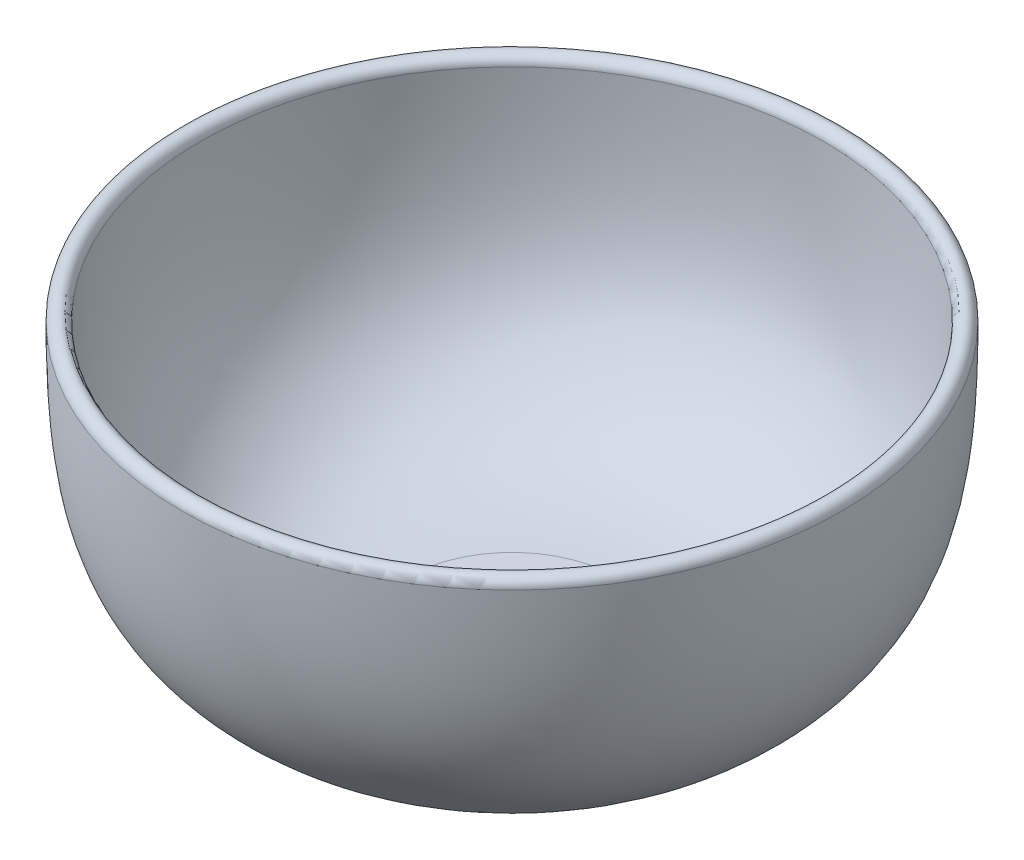
ISO-10303-21;
HEADER;
FILE_DESCRIPTION(('STEP AP214'),'2;1');
FILE_NAME('part.step','',(''),(''),'','','');
FILE_SCHEMA(('AUTOMOTIVE_DESIGN { 1 0 10303 214 1 1 1 1 }'));
ENDSEC;
DATA;
#1=APPLICATION_CONTEXT('core data for automotive mechanical design processes');
#2=APPLICATION_PROTOCOL_DEFINITION('international standard','automotive_design',2000,#1);
#3=PRODUCT_CONTEXT('',#1,'mechanical');
#4=PRODUCT('Part','Part','',(#3));
#5=PRODUCT_RELATED_PRODUCT_CATEGORY('part','',(#4));
#6=PRODUCT_DEFINITION_FORMATION('','',#4);
#7=PRODUCT_DEFINITION_CONTEXT('part definition',#1,'design');
#8=PRODUCT_DEFINITION('design','',#6,#7);
#9=PRODUCT_DEFINITION_SHAPE('','',#8);
#10=(LENGTH_UNIT() NAMED_UNIT(*) SI_UNIT(.MILLI.,.METRE.));
#11=(NAMED_UNIT(*) PLANE_ANGLE_UNIT() SI_UNIT($,.RADIAN.));
#12=(NAMED_UNIT(*) SI_UNIT($,.STERADIAN.) SOLID_ANGLE_UNIT());
#13=UNCERTAINTY_MEASURE_WITH_UNIT(LENGTH_MEASURE(1.E-05),#10,'distance_accuracy_value','');
#14=(GEOMETRIC_REPRESENTATION_CONTEXT(3) GLOBAL_UNCERTAINTY_ASSIGNED_CONTEXT((#13)) GLOBAL_UNIT_ASSIGNED_CONTEXT((#10,
#11,#12)) REPRESENTATION_CONTEXT('',''));
#15=CARTESIAN_POINT('',(0.,0.,0.));
#16=DIRECTION('',(0.,0.,1.));
#17=DIRECTION('',(1.,0.,0.));
#18=AXIS2_PLACEMENT_3D('',#15,#16,#17);
#19=CARTESIAN_POINT('',(0.,-37.46,0.));
#20=DIRECTION('',(0.,-1.,0.));
#21=DIRECTION('',(0.,0.,-1.));
#22=AXIS2_PLACEMENT_3D('',#19,#20,#21);
#23=PLANE('',#22);
#24=CARTESIAN_POINT('',(0.,-37.46,0.));
#25=DIRECTION('',(0.,-1.,0.));
#26=DIRECTION('',(0.,0.,-1.));
#27=AXIS2_PLACEMENT_3D('',#24,#25,#26);
#28=CIRCLE('',#27,30.);
#29=CARTESIAN_POINT('',(0.,-37.46,-30.));
#30=VERTEX_POINT('',#29);
#31=EDGE_CURVE('E10',#30,#30,#28,.T.);
#32=ORIENTED_EDGE('',*,*,#31,.F.);
#33=EDGE_LOOP('',(#32));
#34=FACE_BOUND('',#33,.T.);
#35=ADVANCED_FACE('F30',(#34),#23,.F.);
#36=CARTESIAN_POINT('',(-30.,-37.46,0.));
#37=CARTESIAN_POINT('',(-30.8609876554189,-37.46,0.));
#38=CARTESIAN_POINT('',(-32.6063848749734,-37.4361149045419,0.));
#39=CARTESIAN_POINT('',(-35.9078657835529,-37.2964068616734,0.));
#40=CARTESIAN_POINT('',(-39.8177778317078,-36.9561480547544,0.));
#41=CARTESIAN_POINT('',(-44.1416387662385,-36.3044528033411,0.));
#42=CARTESIAN_POINT('',(-49.4591312105799,-35.1393553086315,0.));
#43=CARTESIAN_POINT('',(-55.3145421037803,-33.18037126707,0.));
#44=CARTESIAN_POINT('',(-61.2602729286897,-30.1809372189808,0.));
#45=CARTESIAN_POINT('',(-66.3060970475642,-26.6748634007322,0.));
#46=CARTESIAN_POINT('',(-70.6280170925905,-22.778750971287,0.));
#47=CARTESIAN_POINT('',(-74.3605139176317,-18.6632436794776,0.));
#48=CARTESIAN_POINT('',(-78.5536869471952,-12.8922017614715,0.));
#49=CARTESIAN_POINT('',(-81.7204520293691,-6.46384050108864,0.));
#50=CARTESIAN_POINT('',(-84.0380987932712,1.01193175229893,0.));
#51=CARTESIAN_POINT('',(-85.3834651682277,7.23379839651148,0.));
#52=CARTESIAN_POINT('',(-86.3679223369294,14.152286295039,0.));
#53=CARTESIAN_POINT('',(-86.9148722671776,20.5612454926086,0.));
#54=CARTESIAN_POINT('',(-87.206068290206,26.1117973199665,0.));
#55=CARTESIAN_POINT('',(-87.3559267331404,30.493774797307,0.));
#56=CARTESIAN_POINT('',(-87.4276274316719,34.3412657490349,0.));
#57=CARTESIAN_POINT('',(-87.4554922617751,37.5283983256624,0.));
#58=CARTESIAN_POINT('',(-87.46,39.1810536668984,0.));
#59=CARTESIAN_POINT('',(-87.46,40.0000000000001,0.));
#60=B_SPLINE_CURVE_WITH_KNOTS('',3,(#36,#37,#38,#39,#40,#41,#42,#43,#44,#45,#46,#47,#48,#49,#50,
#51,#52,#53,#54,#55,#56,#57,#58,#59),.UNSPECIFIED.,.F.,.F.,(4,1,1,1,1,1,1,1,1,1,1,1,1,1,1,1,1,1,
1,1,1,4),(0.,0.015625,0.03125,0.0625,0.09375,0.125,0.1875,0.25,0.3125,0.375,0.4375,0.5,0.625,
0.6875,0.75,0.8125,0.875,0.90625,0.9375,0.96875,0.984375,1.),.UNSPECIFIED.);
#61=CARTESIAN_POINT('',(0.,-40.,0.));
#62=DIRECTION('',(0.,-1.,0.));
#63=AXIS1_PLACEMENT('',#61,#62);
#64=SURFACE_OF_REVOLUTION('',#60,#63);
#65=CARTESIAN_POINT('',(0.,40.0000000000001,0.));
#66=DIRECTION('',(0.,-1.,0.));
#67=DIRECTION('',(0.,0.,-1.));
#68=AXIS2_PLACEMENT_3D('',#65,#66,#67);
#69=CIRCLE('',#68,87.46);
#70=CARTESIAN_POINT('',(0.,40.0000000000001,-87.46));
#71=VERTEX_POINT('',#70);
#72=EDGE_CURVE('E36',#71,#71,#69,.T.);
#73=ORIENTED_EDGE('',*,*,#72,.F.);
#74=EDGE_LOOP('',(#73));
#75=FACE_BOUND('',#74,.T.);
#76=ORIENTED_EDGE('',*,*,#31,.T.);
#77=EDGE_LOOP('',(#76));
#78=FACE_BOUND('',#77,.T.);
#79=ADVANCED_FACE('F68',(#75,#78),#64,.T.);
#80=CARTESIAN_POINT('',(0.,40.,0.));
#81=DIRECTION('',(0.,-1.,0.));
#82=DIRECTION('',(0.,0.,-1.));
#83=AXIS2_PLACEMENT_3D('',#80,#81,#82);
#84=TOROIDAL_SURFACE('',#83,90.,2.54);
#85=CARTESIAN_POINT('',(0.,40.0000000000001,0.));
#86=DIRECTION('',(0.,-1.,0.));
#87=DIRECTION('',(0.,0.,-1.));
#88=AXIS2_PLACEMENT_3D('',#85,#86,#87);
#89=CIRCLE('',#88,92.54);
#90=CARTESIAN_POINT('',(0.,40.0000000000001,-92.54));
#91=VERTEX_POINT('',#90);
#92=EDGE_CURVE('E40',#91,#91,#89,.T.);
#93=ORIENTED_EDGE('',*,*,#92,.F.);
#94=EDGE_LOOP('',(#93));
#95=FACE_BOUND('',#94,.T.);
#96=ORIENTED_EDGE('',*,*,#72,.T.);
#97=EDGE_LOOP('',(#96));
#98=FACE_BOUND('',#97,.T.);
#99=ADVANCED_FACE('F65',(#95,#98),#84,.T.);
#100=CARTESIAN_POINT('',(-92.54,40.0000000000001,0.));
#101=CARTESIAN_POINT('',(-92.54,39.1714013624818,0.));
#102=CARTESIAN_POINT('',(-92.5354424984541,37.5001078512954,0.));
#103=CARTESIAN_POINT('',(-92.5072160098302,34.2703683642136,0.));
#104=CARTESIAN_POINT('',(-92.4344386964938,30.3628240644551,0.));
#105=CARTESIAN_POINT('',(-92.2817421044564,25.8954803250334,0.));
#106=CARTESIAN_POINT('',(-91.9836902187043,20.2119845231245,0.));
#107=CARTESIAN_POINT('',(-91.4201314915007,13.5974022157106,0.));
#108=CARTESIAN_POINT('',(-90.3920576014283,6.35964446557678,0.));
#109=CARTESIAN_POINT('',(-88.9634065117371,-0.257946307391095,0.));
#110=CARTESIAN_POINT('',(-86.4581141709394,-8.35347945843737,0.));
#111=CARTESIAN_POINT('',(-82.9531694814845,-15.4877526105312,0.));
#112=CARTESIAN_POINT('',(-78.2970707365304,-21.8889771988445,0.));
#113=CARTESIAN_POINT('',(-74.2278774634407,-26.3752817797554,0.));
#114=CARTESIAN_POINT('',(-69.4783799847724,-30.6598637827847,0.));
#115=CARTESIAN_POINT('',(-63.8631554212189,-34.563591190295,0.));
#116=CARTESIAN_POINT('',(-57.2570381164248,-37.8938253477865,0.));
#117=CARTESIAN_POINT('',(-50.8228311831737,-40.0426883640367,0.));
#118=CARTESIAN_POINT('',(-45.0564191580813,-41.3051731180868,0.));
#119=CARTESIAN_POINT('',(-40.4083720599776,-42.0050357862125,0.));
#120=CARTESIAN_POINT('',(-36.24292248518,-42.3670418503605,0.));
#121=CARTESIAN_POINT('',(-32.7460389759728,-42.514860457293,0.));
#122=CARTESIAN_POINT('',(-30.9079620028248,-42.54,0.));
#123=CARTESIAN_POINT('',(-30.,-42.54,0.));
#124=B_SPLINE_CURVE_WITH_KNOTS('',3,(#100,#101,#102,#103,#104,#105,#106,#107,#108,#109,#110,
#111,#112,#113,#114,#115,#116,#117,#118,#119,#120,#121,#122,#123),.UNSPECIFIED.,.F.,.F.,(4,1,1,
1,1,1,1,1,1,1,1,1,1,1,1,1,1,1,1,1,1,4),(0.,0.015625,0.03125,0.0625,0.09375,0.125,0.1875,0.25,
0.3125,0.375,0.5,0.5625,0.625,0.6875,0.75,0.8125,0.875,0.90625,0.9375,0.96875,0.984375,1.),.UNSPECIFIED.);
#125=CARTESIAN_POINT('',(0.,-40.,0.));
#126=DIRECTION('',(0.,-1.,0.));
#127=AXIS1_PLACEMENT('',#125,#126);
#128=SURFACE_OF_REVOLUTION('',#124,#127);
#129=CARTESIAN_POINT('',(0.,-42.54,0.));
#130=DIRECTION('',(0.,-1.,0.));
#131=DIRECTION('',(0.,0.,-1.));
#132=AXIS2_PLACEMENT_3D('',#129,#130,#131);
#133=CIRCLE('',#132,30.);
#134=CARTESIAN_POINT('',(0.,-42.54,-30.));
#135=VERTEX_POINT('',#134);
#136=EDGE_CURVE('E44',#135,#135,#133,.T.);
#137=ORIENTED_EDGE('',*,*,#136,.F.);
#138=EDGE_LOOP('',(#137));
#139=FACE_BOUND('',#138,.T.);
#140=ORIENTED_EDGE('',*,*,#92,.T.);
#141=EDGE_LOOP('',(#140));
#142=FACE_BOUND('',#141,.T.);
#143=ADVANCED_FACE('F60',(#139,#142),#128,.T.);
#144=CARTESIAN_POINT('',(0.,-42.54,0.));
#145=DIRECTION('',(0.,1.,0.));
#146=DIRECTION('',(0.,0.,1.));
#147=AXIS2_PLACEMENT_3D('',#144,#145,#146);
#148=PLANE('',#147);
#149=ORIENTED_EDGE('',*,*,#136,.T.);
#150=EDGE_LOOP('',(#149));
#151=FACE_BOUND('',#150,.T.);
#152=ADVANCED_FACE('F64',(#151),#148,.F.);
#153=CLOSED_SHELL('',(#35,#79,#99,#143,#152));
#154=MANIFOLD_SOLID_BREP('B2',#153);
#155=ADVANCED_BREP_SHAPE_REPRESENTATION('',(#18,#154),#14);
#156=SHAPE_DEFINITION_REPRESENTATION(#9,#155);
ENDSEC;
END-ISO-10303-21;
